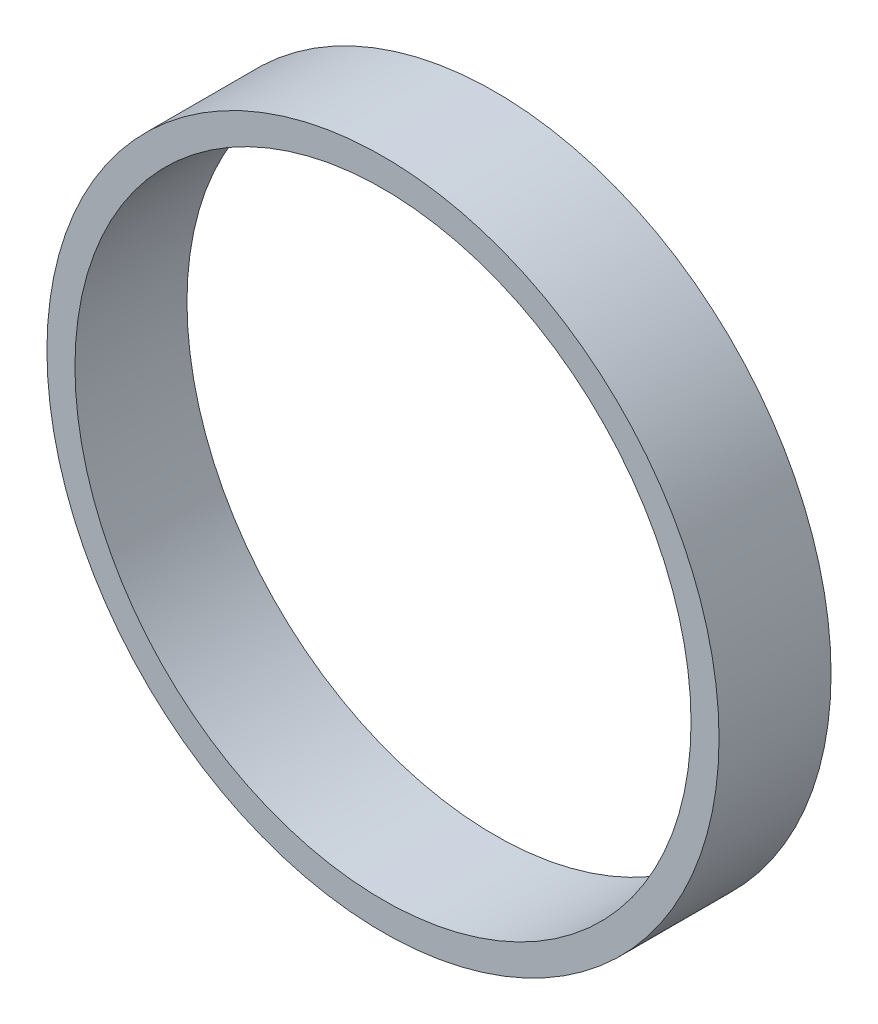
ISO-10303-21;
HEADER;
FILE_DESCRIPTION(('STEP AP214'),'2;1');
FILE_NAME('part.step','',(''),(''),'','','');
FILE_SCHEMA(('AUTOMOTIVE_DESIGN { 1 0 10303 214 1 1 1 1 }'));
ENDSEC;
DATA;
#1=APPLICATION_CONTEXT('core data for automotive mechanical design processes');
#2=APPLICATION_PROTOCOL_DEFINITION('international standard','automotive_design',2000,#1);
#3=PRODUCT_CONTEXT('',#1,'mechanical');
#4=PRODUCT('Part','Part','',(#3));
#5=PRODUCT_RELATED_PRODUCT_CATEGORY('part','',(#4));
#6=PRODUCT_DEFINITION_FORMATION('','',#4);
#7=PRODUCT_DEFINITION_CONTEXT('part definition',#1,'design');
#8=PRODUCT_DEFINITION('design','',#6,#7);
#9=PRODUCT_DEFINITION_SHAPE('','',#8);
#10=(LENGTH_UNIT() NAMED_UNIT(*) SI_UNIT(.MILLI.,.METRE.));
#11=(NAMED_UNIT(*) PLANE_ANGLE_UNIT() SI_UNIT($,.RADIAN.));
#12=(NAMED_UNIT(*) SI_UNIT($,.STERADIAN.) SOLID_ANGLE_UNIT());
#13=UNCERTAINTY_MEASURE_WITH_UNIT(LENGTH_MEASURE(1.E-05),#10,'distance_accuracy_value','');
#14=(GEOMETRIC_REPRESENTATION_CONTEXT(3) GLOBAL_UNCERTAINTY_ASSIGNED_CONTEXT((#13)) GLOBAL_UNIT_ASSIGNED_CONTEXT((#10,
#11,#12)) REPRESENTATION_CONTEXT('',''));
#15=CARTESIAN_POINT('',(0.,0.,0.));
#16=DIRECTION('',(0.,0.,1.));
#17=DIRECTION('',(1.,0.,0.));
#18=AXIS2_PLACEMENT_3D('',#15,#16,#17);
#19=CARTESIAN_POINT('',(0.,0.,10.));
#20=DIRECTION('',(0.,0.,1.));
#21=DIRECTION('',(1.,0.,0.));
#22=AXIS2_PLACEMENT_3D('',#19,#20,#21);
#23=PLANE('',#22);
#24=CARTESIAN_POINT('',(0.,0.,10.));
#25=DIRECTION('',(0.,0.,1.));
#26=DIRECTION('',(1.,0.,0.));
#27=AXIS2_PLACEMENT_3D('',#24,#25,#26);
#28=CIRCLE('',#27,30.);
#29=CARTESIAN_POINT('',(30.,0.,10.));
#30=VERTEX_POINT('',#29);
#31=EDGE_CURVE('E10',#30,#30,#28,.T.);
#32=ORIENTED_EDGE('',*,*,#31,.T.);
#33=EDGE_LOOP('',(#32));
#34=FACE_BOUND('',#33,.T.);
#35=CARTESIAN_POINT('',(0.,0.,10.));
#36=DIRECTION('',(0.,0.,1.));
#37=DIRECTION('',(1.,0.,0.));
#38=AXIS2_PLACEMENT_3D('',#35,#36,#37);
#39=CIRCLE('',#38,27.5);
#40=CARTESIAN_POINT('',(27.5,0.,10.));
#41=VERTEX_POINT('',#40);
#42=EDGE_CURVE('E50',#41,#41,#39,.T.);
#43=ORIENTED_EDGE('',*,*,#42,.F.);
#44=EDGE_LOOP('',(#43));
#45=FACE_BOUND('',#44,.T.);
#46=ADVANCED_FACE('F37',(#34,#45),#23,.T.);
#47=CARTESIAN_POINT('',(0.,0.,0.));
#48=DIRECTION('',(0.,0.,1.));
#49=DIRECTION('',(1.,0.,0.));
#50=AXIS2_PLACEMENT_3D('',#47,#48,#49);
#51=PLANE('',#50);
#52=CARTESIAN_POINT('',(0.,0.,0.));
#53=DIRECTION('',(0.,0.,1.));
#54=DIRECTION('',(1.,0.,0.));
#55=AXIS2_PLACEMENT_3D('',#52,#53,#54);
#56=CIRCLE('',#55,30.);
#57=CARTESIAN_POINT('',(30.,0.,0.));
#58=VERTEX_POINT('',#57);
#59=EDGE_CURVE('E41',#58,#58,#56,.T.);
#60=ORIENTED_EDGE('',*,*,#59,.F.);
#61=EDGE_LOOP('',(#60));
#62=FACE_BOUND('',#61,.T.);
#63=CARTESIAN_POINT('',(0.,0.,0.));
#64=DIRECTION('',(0.,0.,1.));
#65=DIRECTION('',(1.,0.,0.));
#66=AXIS2_PLACEMENT_3D('',#63,#64,#65);
#67=CIRCLE('',#66,27.5);
#68=CARTESIAN_POINT('',(27.5,0.,0.));
#69=VERTEX_POINT('',#68);
#70=EDGE_CURVE('E52',#69,#69,#67,.T.);
#71=ORIENTED_EDGE('',*,*,#70,.T.);
#72=EDGE_LOOP('',(#71));
#73=FACE_BOUND('',#72,.T.);
#74=ADVANCED_FACE('F64',(#62,#73),#51,.F.);
#75=CARTESIAN_POINT('',(0.,0.,10.));
#76=DIRECTION('',(0.,0.,-1.));
#77=DIRECTION('',(-1.,0.,0.));
#78=AXIS2_PLACEMENT_3D('',#75,#76,#77);
#79=CYLINDRICAL_SURFACE('',#78,30.);
#80=ORIENTED_EDGE('',*,*,#31,.F.);
#81=EDGE_LOOP('',(#80));
#82=FACE_BOUND('',#81,.T.);
#83=ORIENTED_EDGE('',*,*,#59,.T.);
#84=EDGE_LOOP('',(#83));
#85=FACE_BOUND('',#84,.T.);
#86=ADVANCED_FACE('F39',(#82,#85),#79,.T.);
#87=CARTESIAN_POINT('',(0.,0.,10.));
#88=DIRECTION('',(0.,0.,-1.));
#89=DIRECTION('',(-1.,0.,0.));
#90=AXIS2_PLACEMENT_3D('',#87,#88,#89);
#91=CYLINDRICAL_SURFACE('',#90,27.5);
#92=ORIENTED_EDGE('',*,*,#42,.T.);
#93=EDGE_LOOP('',(#92));
#94=FACE_BOUND('',#93,.T.);
#95=ORIENTED_EDGE('',*,*,#70,.F.);
#96=EDGE_LOOP('',(#95));
#97=FACE_BOUND('',#96,.T.);
#98=ADVANCED_FACE('F60',(#94,#97),#91,.F.);
#99=CLOSED_SHELL('',(#46,#74,#86,#98));
#100=MANIFOLD_SOLID_BREP('B2',#99);
#101=ADVANCED_BREP_SHAPE_REPRESENTATION('',(#18,#100),#14);
#102=SHAPE_DEFINITION_REPRESENTATION(#9,#101);
ENDSEC;
END-ISO-10303-21;
